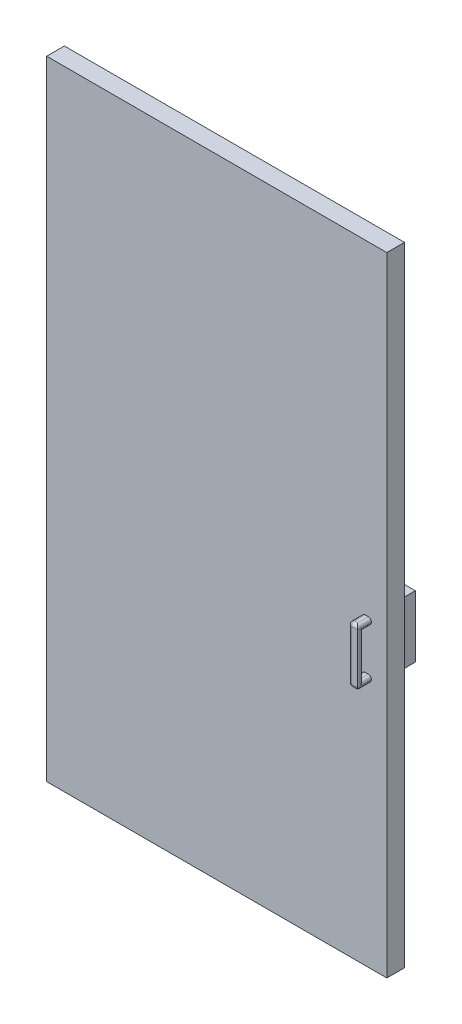
ISO-10303-21;
HEADER;
FILE_DESCRIPTION(('STEP AP214'),'2;1');
FILE_NAME('part.step','',(''),(''),'','','');
FILE_SCHEMA(('AUTOMOTIVE_DESIGN { 1 0 10303 214 1 1 1 1 }'));
ENDSEC;
DATA;
#1=APPLICATION_CONTEXT('core data for automotive mechanical design processes');
#2=APPLICATION_PROTOCOL_DEFINITION('international standard','automotive_design',2000,#1);
#3=PRODUCT_CONTEXT('',#1,'mechanical');
#4=PRODUCT('Part','Part','',(#3));
#5=PRODUCT_RELATED_PRODUCT_CATEGORY('part','',(#4));
#6=PRODUCT_DEFINITION_FORMATION('','',#4);
#7=PRODUCT_DEFINITION_CONTEXT('part definition',#1,'design');
#8=PRODUCT_DEFINITION('design','',#6,#7);
#9=PRODUCT_DEFINITION_SHAPE('','',#8);
#10=(LENGTH_UNIT() NAMED_UNIT(*) SI_UNIT(.MILLI.,.METRE.));
#11=(NAMED_UNIT(*) PLANE_ANGLE_UNIT() SI_UNIT($,.RADIAN.));
#12=(NAMED_UNIT(*) SI_UNIT($,.STERADIAN.) SOLID_ANGLE_UNIT());
#13=UNCERTAINTY_MEASURE_WITH_UNIT(LENGTH_MEASURE(1.E-05),#10,'distance_accuracy_value','');
#14=(GEOMETRIC_REPRESENTATION_CONTEXT(3) GLOBAL_UNCERTAINTY_ASSIGNED_CONTEXT((#13)) GLOBAL_UNIT_ASSIGNED_CONTEXT((#10,
#11,#12)) REPRESENTATION_CONTEXT('',''));
#15=CARTESIAN_POINT('',(0.,0.,0.));
#16=DIRECTION('',(0.,0.,1.));
#17=DIRECTION('',(1.,0.,0.));
#18=AXIS2_PLACEMENT_3D('',#15,#16,#17);
#19=CARTESIAN_POINT('',(0.,0.,0.));
#20=DIRECTION('',(0.,0.,1.));
#21=DIRECTION('',(1.,0.,0.));
#22=AXIS2_PLACEMENT_3D('',#19,#20,#21);
#23=PLANE('',#22);
#24=DIRECTION('',(0.,-1.,0.));
#25=VECTOR('',#24,1.);
#26=CARTESIAN_POINT('',(-65.,-612.048700510207,0.));
#27=LINE('',#26,#25);
#28=CARTESIAN_POINT('',(-65.,-786.763140089581,0.));
#29=VERTEX_POINT('',#28);
#30=CARTESIAN_POINT('',(-65.,-812.048700510207,0.));
#31=VERTEX_POINT('',#30);
#32=EDGE_CURVE('E264',#29,#31,#27,.T.);
#33=ORIENTED_EDGE('',*,*,#32,.F.);
#34=DIRECTION('',(1.,0.,0.));
#35=VECTOR('',#34,1.);
#36=CARTESIAN_POINT('',(-304.278655323462,-786.763140089581,0.));
#37=LINE('',#36,#35);
#38=CARTESIAN_POINT('',(-135.,-786.763140089581,0.));
#39=VERTEX_POINT('',#38);
#40=EDGE_CURVE('E56',#39,#29,#37,.T.);
#41=ORIENTED_EDGE('',*,*,#40,.F.);
#42=DIRECTION('',(0.,1.,0.));
#43=VECTOR('',#42,1.);
#44=CARTESIAN_POINT('',(-135.,-612.048700510207,0.));
#45=LINE('',#44,#43);
#46=CARTESIAN_POINT('',(-135.,-812.048700510207,0.));
#47=VERTEX_POINT('',#46);
#48=EDGE_CURVE('E283',#47,#39,#45,.T.);
#49=ORIENTED_EDGE('',*,*,#48,.F.);
#50=DIRECTION('',(-1.,0.,0.));
#51=VECTOR('',#50,1.);
#52=CARTESIAN_POINT('',(-65.,-812.048700510207,0.));
#53=LINE('',#52,#51);
#54=EDGE_CURVE('E279',#31,#47,#53,.T.);
#55=ORIENTED_EDGE('',*,*,#54,.F.);
#56=EDGE_LOOP('',(#33,#41,#49,#55));
#57=FACE_BOUND('',#56,.T.);
#58=DIRECTION('',(-1.,0.,0.));
#59=VECTOR('',#58,1.);
#60=CARTESIAN_POINT('',(0.,446.201837212028,0.));
#61=LINE('',#60,#59);
#62=CARTESIAN_POINT('',(0.,446.201837212028,0.));
#63=VERTEX_POINT('',#62);
#64=CARTESIAN_POINT('',(-1100.,446.201837212028,0.));
#65=VERTEX_POINT('',#64);
#66=EDGE_CURVE('E317',#63,#65,#61,.T.);
#67=ORIENTED_EDGE('',*,*,#66,.F.);
#68=DIRECTION('',(0.,1.,0.));
#69=VECTOR('',#68,1.);
#70=CARTESIAN_POINT('',(0.,0.,0.));
#71=LINE('',#70,#69);
#72=CARTESIAN_POINT('',(0.,-1585.79816278797,0.));
#73=VERTEX_POINT('',#72);
#74=EDGE_CURVE('E335',#73,#63,#71,.T.);
#75=ORIENTED_EDGE('',*,*,#74,.F.);
#76=DIRECTION('',(1.,0.,0.));
#77=VECTOR('',#76,1.);
#78=CARTESIAN_POINT('',(-1100.,-1585.79816278797,0.));
#79=LINE('',#78,#77);
#80=CARTESIAN_POINT('',(-1100.,-1585.79816278797,0.));
#81=VERTEX_POINT('',#80);
#82=EDGE_CURVE('E346',#81,#73,#79,.T.);
#83=ORIENTED_EDGE('',*,*,#82,.F.);
#84=DIRECTION('',(0.,-1.,0.));
#85=VECTOR('',#84,1.);
#86=CARTESIAN_POINT('',(-1100.,446.201837212028,0.));
#87=LINE('',#86,#85);
#88=EDGE_CURVE('E344',#65,#81,#87,.T.);
#89=ORIENTED_EDGE('',*,*,#88,.F.);
#90=EDGE_LOOP('',(#67,#75,#83,#89));
#91=FACE_BOUND('',#90,.T.);
#92=CARTESIAN_POINT('',(-65.,-612.048700510207,0.));
#93=VERTEX_POINT('',#92);
#94=CARTESIAN_POINT('',(-65.,-627.935575947084,0.));
#95=VERTEX_POINT('',#94);
#96=EDGE_CURVE('E277',#93,#95,#27,.T.);
#97=ORIENTED_EDGE('',*,*,#96,.F.);
#98=DIRECTION('',(1.,0.,0.));
#99=VECTOR('',#98,1.);
#100=CARTESIAN_POINT('',(-65.,-612.048700510207,0.));
#101=LINE('',#100,#99);
#102=CARTESIAN_POINT('',(-135.,-612.048700510207,0.));
#103=VERTEX_POINT('',#102);
#104=EDGE_CURVE('E270',#103,#93,#101,.T.);
#105=ORIENTED_EDGE('',*,*,#104,.F.);
#106=CARTESIAN_POINT('',(-135.,-627.935575947084,0.));
#107=VERTEX_POINT('',#106);
#108=EDGE_CURVE('E282',#107,#103,#45,.T.);
#109=ORIENTED_EDGE('',*,*,#108,.F.);
#110=DIRECTION('',(1.,0.,0.));
#111=VECTOR('',#110,1.);
#112=CARTESIAN_POINT('',(-304.278655323462,-627.935575947084,0.));
#113=LINE('',#112,#111);
#114=EDGE_CURVE('E258',#107,#95,#113,.T.);
#115=ORIENTED_EDGE('',*,*,#114,.T.);
#116=EDGE_LOOP('',(#97,#105,#109,#115));
#117=FACE_BOUND('',#116,.T.);
#118=ADVANCED_FACE('F39',(#57,#91,#117),#23,.F.);
#119=CARTESIAN_POINT('',(-79.9999999999999,-603.798162787972,101.15));
#120=DIRECTION('',(1.,0.,0.));
#121=DIRECTION('',(0.,1.,0.));
#122=AXIS2_PLACEMENT_3D('',#119,#120,#121);
#123=PLANE('',#122);
#124=DIRECTION('',(0.,-1.,0.));
#125=VECTOR('',#124,1.);
#126=CARTESIAN_POINT('',(-79.9999999999999,-603.798162787972,57.15));
#127=LINE('',#126,#125);
#128=CARTESIAN_POINT('',(-79.9999999999999,-774.798162787972,57.15));
#129=VERTEX_POINT('',#128);
#130=CARTESIAN_POINT('',(-79.9999999999999,-775.798162787972,57.15));
#131=VERTEX_POINT('',#130);
#132=EDGE_CURVE('E325',#129,#131,#127,.T.);
#133=ORIENTED_EDGE('',*,*,#132,.T.);
#134=DIRECTION('',(0.,0.,-1.));
#135=VECTOR('',#134,1.);
#136=CARTESIAN_POINT('',(-79.9999999999999,-775.798162787972,101.15));
#137=LINE('',#136,#135);
#138=CARTESIAN_POINT('',(-79.9999999999999,-775.798162787972,91.15));
#139=VERTEX_POINT('',#138);
#140=EDGE_CURVE('E388',#131,#139,#137,.F.);
#141=ORIENTED_EDGE('',*,*,#140,.T.);
#142=DIRECTION('',(0.,-1.,0.));
#143=VECTOR('',#142,1.);
#144=CARTESIAN_POINT('',(-79.9999999999999,-603.798162787972,91.15));
#145=LINE('',#144,#143);
#146=CARTESIAN_POINT('',(-79.9999999999999,-774.798162787972,91.15));
#147=VERTEX_POINT('',#146);
#148=EDGE_CURVE('E384',#139,#147,#145,.F.);
#149=ORIENTED_EDGE('',*,*,#148,.T.);
#150=DIRECTION('',(0.,0.,-1.));
#151=VECTOR('',#150,1.);
#152=CARTESIAN_POINT('',(-79.9999999999999,-774.798162787972,57.15));
#153=LINE('',#152,#151);
#154=EDGE_CURVE('E386',#147,#129,#153,.T.);
#155=ORIENTED_EDGE('',*,*,#154,.T.);
#156=EDGE_LOOP('',(#133,#141,#149,#155));
#157=FACE_BOUND('',#156,.T.);
#158=ADVANCED_FACE('F558',(#157),#123,.F.);
#159=CARTESIAN_POINT('',(-49.9999999999999,-603.798162787972,101.15));
#160=DIRECTION('',(-1.,0.,0.));
#161=DIRECTION('',(0.,-1.,0.));
#162=AXIS2_PLACEMENT_3D('',#159,#160,#161);
#163=PLANE('',#162);
#164=DIRECTION('',(0.,1.,0.));
#165=VECTOR('',#164,1.);
#166=CARTESIAN_POINT('',(-49.9999999999999,-603.798162787972,57.15));
#167=LINE('',#166,#165);
#168=CARTESIAN_POINT('',(-49.9999999999999,-614.798162787972,57.15));
#169=VERTEX_POINT('',#168);
#170=CARTESIAN_POINT('',(-49.9999999999999,-613.798162787972,57.15));
#171=VERTEX_POINT('',#170);
#172=EDGE_CURVE('E303',#169,#171,#167,.T.);
#173=ORIENTED_EDGE('',*,*,#172,.T.);
#174=DIRECTION('',(0.,0.,-1.));
#175=VECTOR('',#174,1.);
#176=CARTESIAN_POINT('',(-49.9999999999999,-613.798162787972,101.15));
#177=LINE('',#176,#175);
#178=CARTESIAN_POINT('',(-49.9999999999999,-613.798162787972,101.15));
#179=VERTEX_POINT('',#178);
#180=EDGE_CURVE('E403',#171,#179,#177,.F.);
#181=ORIENTED_EDGE('',*,*,#180,.T.);
#182=DIRECTION('',(0.,1.,0.));
#183=VECTOR('',#182,1.);
#184=CARTESIAN_POINT('',(-49.9999999999999,-603.798162787972,101.15));
#185=LINE('',#184,#183);
#186=CARTESIAN_POINT('',(-49.9999999999999,-775.798162787972,101.15));
#187=VERTEX_POINT('',#186);
#188=EDGE_CURVE('E314',#187,#179,#185,.T.);
#189=ORIENTED_EDGE('',*,*,#188,.F.);
#190=DIRECTION('',(0.,0.,-1.));
#191=VECTOR('',#190,1.);
#192=CARTESIAN_POINT('',(-49.9999999999999,-775.798162787972,101.15));
#193=LINE('',#192,#191);
#194=CARTESIAN_POINT('',(-49.9999999999999,-775.798162787972,57.15));
#195=VERTEX_POINT('',#194);
#196=EDGE_CURVE('E395',#187,#195,#193,.T.);
#197=ORIENTED_EDGE('',*,*,#196,.T.);
#198=CARTESIAN_POINT('',(-49.9999999999999,-774.798162787972,57.15));
#199=VERTEX_POINT('',#198);
#200=EDGE_CURVE('E319',#195,#199,#167,.T.);
#201=ORIENTED_EDGE('',*,*,#200,.T.);
#202=DIRECTION('',(0.,0.,-1.));
#203=VECTOR('',#202,1.);
#204=CARTESIAN_POINT('',(-49.9999999999999,-774.798162787972,83.15));
#205=LINE('',#204,#203);
#206=CARTESIAN_POINT('',(-49.9999999999999,-774.798162787972,93.15));
#207=VERTEX_POINT('',#206);
#208=EDGE_CURVE('E397',#199,#207,#205,.F.);
#209=ORIENTED_EDGE('',*,*,#208,.T.);
#210=DIRECTION('',(0.,-1.,0.));
#211=VECTOR('',#210,1.);
#212=CARTESIAN_POINT('',(-49.9999999999999,-624.798162787972,93.15));
#213=LINE('',#212,#211);
#214=CARTESIAN_POINT('',(-49.9999999999999,-614.798162787972,93.15));
#215=VERTEX_POINT('',#214);
#216=EDGE_CURVE('E399',#207,#215,#213,.F.);
#217=ORIENTED_EDGE('',*,*,#216,.T.);
#218=DIRECTION('',(0.,0.,1.));
#219=VECTOR('',#218,1.);
#220=CARTESIAN_POINT('',(-49.9999999999999,-614.798162787972,57.15));
#221=LINE('',#220,#219);
#222=EDGE_CURVE('E401',#215,#169,#221,.F.);
#223=ORIENTED_EDGE('',*,*,#222,.T.);
#224=EDGE_LOOP('',(#173,#181,#189,#197,#201,#209,#217,#223));
#225=FACE_BOUND('',#224,.T.);
#226=ADVANCED_FACE('F545',(#225),#163,.F.);
#227=DIRECTION('',(0.,-1.,0.));
#228=VECTOR('',#227,1.);
#229=CARTESIAN_POINT('',(-79.9999999999999,-603.798162787972,91.15));
#230=LINE('',#229,#228);
#231=CARTESIAN_POINT('',(-79.9999999999999,-614.798162787972,91.15));
#232=VERTEX_POINT('',#231);
#233=CARTESIAN_POINT('',(-79.9999999999999,-613.798162787972,91.15));
#234=VERTEX_POINT('',#233);
#235=EDGE_CURVE('E378',#232,#234,#230,.F.);
#236=ORIENTED_EDGE('',*,*,#235,.T.);
#237=DIRECTION('',(0.,0.,-1.));
#238=VECTOR('',#237,1.);
#239=CARTESIAN_POINT('',(-79.9999999999999,-613.798162787972,101.15));
#240=LINE('',#239,#238);
#241=CARTESIAN_POINT('',(-79.9999999999999,-613.798162787972,57.15));
#242=VERTEX_POINT('',#241);
#243=EDGE_CURVE('E382',#234,#242,#240,.T.);
#244=ORIENTED_EDGE('',*,*,#243,.T.);
#245=CARTESIAN_POINT('',(-79.9999999999999,-614.798162787972,57.15));
#246=VERTEX_POINT('',#245);
#247=EDGE_CURVE('E326',#242,#246,#127,.T.);
#248=ORIENTED_EDGE('',*,*,#247,.T.);
#249=DIRECTION('',(0.,0.,1.));
#250=VECTOR('',#249,1.);
#251=CARTESIAN_POINT('',(-79.9999999999999,-614.798162787972,83.15));
#252=LINE('',#251,#250);
#253=EDGE_CURVE('E380',#246,#232,#252,.T.);
#254=ORIENTED_EDGE('',*,*,#253,.T.);
#255=EDGE_LOOP('',(#236,#244,#248,#254));
#256=FACE_BOUND('',#255,.T.);
#257=ADVANCED_FACE('F515',(#256),#123,.F.);
#258=CARTESIAN_POINT('',(0.,0.,57.15));
#259=DIRECTION('',(0.,0.,1.));
#260=DIRECTION('',(1.,0.,0.));
#261=AXIS2_PLACEMENT_3D('',#258,#259,#260);
#262=PLANE('',#261);
#263=DIRECTION('',(-1.,0.,0.));
#264=VECTOR('',#263,1.);
#265=CARTESIAN_POINT('',(-35.9999999999999,-764.798162787972,57.15));
#266=LINE('',#265,#264);
#267=CARTESIAN_POINT('',(-59.9999999999999,-764.798162787972,57.15));
#268=VERTEX_POINT('',#267);
#269=CARTESIAN_POINT('',(-69.9999999999999,-764.798162787972,57.15));
#270=VERTEX_POINT('',#269);
#271=EDGE_CURVE('E300',#268,#270,#266,.T.);
#272=ORIENTED_EDGE('',*,*,#271,.F.);
#273=CARTESIAN_POINT('',(-59.9999999999999,-774.798162787972,57.15));
#274=DIRECTION('',(0.,0.,1.));
#275=DIRECTION('',(1.,0.,0.));
#276=AXIS2_PLACEMENT_3D('',#273,#274,#275);
#277=CIRCLE('',#276,10.);
#278=EDGE_CURVE('E423',#268,#199,#277,.F.);
#279=ORIENTED_EDGE('',*,*,#278,.T.);
#280=ORIENTED_EDGE('',*,*,#200,.F.);
#281=CARTESIAN_POINT('',(-59.9999999999999,-775.798162787972,57.15));
#282=DIRECTION('',(0.,0.,1.));
#283=DIRECTION('',(1.,0.,0.));
#284=AXIS2_PLACEMENT_3D('',#281,#282,#283);
#285=CIRCLE('',#284,10.);
#286=CARTESIAN_POINT('',(-59.9999999999999,-785.798162787972,57.15));
#287=VERTEX_POINT('',#286);
#288=EDGE_CURVE('E425',#195,#287,#285,.F.);
#289=ORIENTED_EDGE('',*,*,#288,.T.);
#290=DIRECTION('',(1.,0.,0.));
#291=VECTOR('',#290,1.);
#292=CARTESIAN_POINT('',(-79.9999999999999,-785.798162787972,57.15));
#293=LINE('',#292,#291);
#294=CARTESIAN_POINT('',(-69.9999999999999,-785.798162787972,57.15));
#295=VERTEX_POINT('',#294);
#296=EDGE_CURVE('E318',#295,#287,#293,.T.);
#297=ORIENTED_EDGE('',*,*,#296,.F.);
#298=CARTESIAN_POINT('',(-69.9999999999999,-775.798162787972,57.15));
#299=DIRECTION('',(0.,0.,1.));
#300=DIRECTION('',(1.,0.,0.));
#301=AXIS2_PLACEMENT_3D('',#298,#299,#300);
#302=CIRCLE('',#301,10.);
#303=EDGE_CURVE('E48',#295,#131,#302,.F.);
#304=ORIENTED_EDGE('',*,*,#303,.T.);
#305=ORIENTED_EDGE('',*,*,#132,.F.);
#306=CARTESIAN_POINT('',(-69.9999999999999,-774.798162787972,57.15));
#307=DIRECTION('',(0.,0.,1.));
#308=DIRECTION('',(1.,0.,0.));
#309=AXIS2_PLACEMENT_3D('',#306,#307,#308);
#310=CIRCLE('',#309,10.);
#311=EDGE_CURVE('E11',#129,#270,#310,.F.);
#312=ORIENTED_EDGE('',*,*,#311,.T.);
#313=EDGE_LOOP('',(#272,#279,#280,#289,#297,#304,#305,#312));
#314=FACE_BOUND('',#313,.T.);
#315=ORIENTED_EDGE('',*,*,#172,.F.);
#316=CARTESIAN_POINT('',(-59.9999999999999,-614.798162787972,57.15));
#317=DIRECTION('',(0.,0.,1.));
#318=DIRECTION('',(1.,0.,0.));
#319=AXIS2_PLACEMENT_3D('',#316,#317,#318);
#320=CIRCLE('',#319,10.);
#321=CARTESIAN_POINT('',(-59.9999999999999,-624.798162787972,57.15));
#322=VERTEX_POINT('',#321);
#323=EDGE_CURVE('E421',#169,#322,#320,.F.);
#324=ORIENTED_EDGE('',*,*,#323,.T.);
#325=DIRECTION('',(-1.,0.,0.));
#326=VECTOR('',#325,1.);
#327=CARTESIAN_POINT('',(-35.9999999999999,-624.798162787972,57.15));
#328=LINE('',#327,#326);
#329=CARTESIAN_POINT('',(-69.9999999999999,-624.798162787972,57.15));
#330=VERTEX_POINT('',#329);
#331=EDGE_CURVE('E304',#322,#330,#328,.T.);
#332=ORIENTED_EDGE('',*,*,#331,.T.);
#333=CARTESIAN_POINT('',(-69.9999999999999,-614.798162787972,57.15));
#334=DIRECTION('',(0.,0.,1.));
#335=DIRECTION('',(1.,0.,0.));
#336=AXIS2_PLACEMENT_3D('',#333,#334,#335);
#337=CIRCLE('',#336,10.);
#338=EDGE_CURVE('E417',#330,#246,#337,.F.);
#339=ORIENTED_EDGE('',*,*,#338,.T.);
#340=ORIENTED_EDGE('',*,*,#247,.F.);
#341=CARTESIAN_POINT('',(-69.9999999999999,-613.798162787972,57.15));
#342=DIRECTION('',(0.,0.,1.));
#343=DIRECTION('',(1.,0.,0.));
#344=AXIS2_PLACEMENT_3D('',#341,#342,#343);
#345=CIRCLE('',#344,10.);
#346=CARTESIAN_POINT('',(-69.9999999999999,-603.798162787972,57.15));
#347=VERTEX_POINT('',#346);
#348=EDGE_CURVE('E415',#242,#347,#345,.F.);
#349=ORIENTED_EDGE('',*,*,#348,.T.);
#350=DIRECTION('',(-1.,0.,0.));
#351=VECTOR('',#350,1.);
#352=CARTESIAN_POINT('',(-79.9999999999999,-603.798162787972,57.15));
#353=LINE('',#352,#351);
#354=CARTESIAN_POINT('',(-59.9999999999999,-603.798162787972,57.15));
#355=VERTEX_POINT('',#354);
#356=EDGE_CURVE('E322',#355,#347,#353,.T.);
#357=ORIENTED_EDGE('',*,*,#356,.F.);
#358=CARTESIAN_POINT('',(-59.9999999999999,-613.798162787972,57.15));
#359=DIRECTION('',(0.,0.,1.));
#360=DIRECTION('',(1.,0.,0.));
#361=AXIS2_PLACEMENT_3D('',#358,#359,#360);
#362=CIRCLE('',#361,10.);
#363=EDGE_CURVE('E419',#355,#171,#362,.F.);
#364=ORIENTED_EDGE('',*,*,#363,.T.);
#365=EDGE_LOOP('',(#315,#324,#332,#339,#340,#349,#357,#364));
#366=FACE_BOUND('',#365,.T.);
#367=DIRECTION('',(-1.,0.,0.));
#368=VECTOR('',#367,1.);
#369=CARTESIAN_POINT('',(0.,446.201837212028,57.15));
#370=LINE('',#369,#368);
#371=CARTESIAN_POINT('',(0.,446.201837212028,57.15));
#372=VERTEX_POINT('',#371);
#373=CARTESIAN_POINT('',(-1100.,446.201837212028,57.15));
#374=VERTEX_POINT('',#373);
#375=EDGE_CURVE('E331',#372,#374,#370,.T.);
#376=ORIENTED_EDGE('',*,*,#375,.T.);
#377=DIRECTION('',(0.,-1.,0.));
#378=VECTOR('',#377,1.);
#379=CARTESIAN_POINT('',(-1100.,446.201837212028,57.15));
#380=LINE('',#379,#378);
#381=CARTESIAN_POINT('',(-1100.,-1585.79816278797,57.15));
#382=VERTEX_POINT('',#381);
#383=EDGE_CURVE('E334',#374,#382,#380,.T.);
#384=ORIENTED_EDGE('',*,*,#383,.T.);
#385=DIRECTION('',(1.,0.,0.));
#386=VECTOR('',#385,1.);
#387=CARTESIAN_POINT('',(-1100.,-1585.79816278797,57.15));
#388=LINE('',#387,#386);
#389=CARTESIAN_POINT('',(0.,-1585.79816278797,57.15));
#390=VERTEX_POINT('',#389);
#391=EDGE_CURVE('E337',#382,#390,#388,.T.);
#392=ORIENTED_EDGE('',*,*,#391,.T.);
#393=DIRECTION('',(0.,1.,0.));
#394=VECTOR('',#393,1.);
#395=CARTESIAN_POINT('',(0.,-1585.79816278797,57.15));
#396=LINE('',#395,#394);
#397=EDGE_CURVE('E339',#390,#372,#396,.T.);
#398=ORIENTED_EDGE('',*,*,#397,.T.);
#399=EDGE_LOOP('',(#376,#384,#392,#398));
#400=FACE_BOUND('',#399,.T.);
#401=ADVANCED_FACE('F482',(#314,#366,#400),#262,.T.);
#402=CARTESIAN_POINT('',(0.,446.201837212028,57.15));
#403=DIRECTION('',(0.,-1.,0.));
#404=DIRECTION('',(1.,0.,0.));
#405=AXIS2_PLACEMENT_3D('',#402,#403,#404);
#406=PLANE('',#405);
#407=ORIENTED_EDGE('',*,*,#66,.T.);
#408=DIRECTION('',(0.,0.,-1.));
#409=VECTOR('',#408,1.);
#410=CARTESIAN_POINT('',(-1100.,446.201837212028,57.15));
#411=LINE('',#410,#409);
#412=EDGE_CURVE('E358',#374,#65,#411,.T.);
#413=ORIENTED_EDGE('',*,*,#412,.F.);
#414=ORIENTED_EDGE('',*,*,#375,.F.);
#415=DIRECTION('',(0.,0.,-1.));
#416=VECTOR('',#415,1.);
#417=CARTESIAN_POINT('',(0.,446.201837212028,57.15));
#418=LINE('',#417,#416);
#419=EDGE_CURVE('E341',#372,#63,#418,.T.);
#420=ORIENTED_EDGE('',*,*,#419,.T.);
#421=EDGE_LOOP('',(#407,#413,#414,#420));
#422=FACE_BOUND('',#421,.T.);
#423=ADVANCED_FACE('F581',(#422),#406,.F.);
#424=CARTESIAN_POINT('',(-1100.,446.201837212028,57.15));
#425=DIRECTION('',(1.,0.,0.));
#426=DIRECTION('',(0.,0.,-1.));
#427=AXIS2_PLACEMENT_3D('',#424,#425,#426);
#428=PLANE('',#427);
#429=ORIENTED_EDGE('',*,*,#88,.T.);
#430=DIRECTION('',(0.,0.,-1.));
#431=VECTOR('',#430,1.);
#432=CARTESIAN_POINT('',(-1100.,-1585.79816278797,57.15));
#433=LINE('',#432,#431);
#434=EDGE_CURVE('E355',#382,#81,#433,.T.);
#435=ORIENTED_EDGE('',*,*,#434,.F.);
#436=ORIENTED_EDGE('',*,*,#383,.F.);
#437=ORIENTED_EDGE('',*,*,#412,.T.);
#438=EDGE_LOOP('',(#429,#435,#436,#437));
#439=FACE_BOUND('',#438,.T.);
#440=ADVANCED_FACE('F577',(#439),#428,.F.);
#441=CARTESIAN_POINT('',(-1100.,-1585.79816278797,57.15));
#442=DIRECTION('',(0.,1.,0.));
#443=DIRECTION('',(0.,0.,1.));
#444=AXIS2_PLACEMENT_3D('',#441,#442,#443);
#445=PLANE('',#444);
#446=ORIENTED_EDGE('',*,*,#82,.T.);
#447=DIRECTION('',(0.,0.,-1.));
#448=VECTOR('',#447,1.);
#449=CARTESIAN_POINT('',(0.,-1585.79816278797,57.15));
#450=LINE('',#449,#448);
#451=EDGE_CURVE('E352',#390,#73,#450,.T.);
#452=ORIENTED_EDGE('',*,*,#451,.F.);
#453=ORIENTED_EDGE('',*,*,#391,.F.);
#454=ORIENTED_EDGE('',*,*,#434,.T.);
#455=EDGE_LOOP('',(#446,#452,#453,#454));
#456=FACE_BOUND('',#455,.T.);
#457=ADVANCED_FACE('F573',(#456),#445,.F.);
#458=CARTESIAN_POINT('',(0.,0.,57.15));
#459=DIRECTION('',(-1.,0.,0.));
#460=DIRECTION('',(0.,0.,1.));
#461=AXIS2_PLACEMENT_3D('',#458,#459,#460);
#462=PLANE('',#461);
#463=ORIENTED_EDGE('',*,*,#74,.T.);
#464=ORIENTED_EDGE('',*,*,#419,.F.);
#465=ORIENTED_EDGE('',*,*,#397,.F.);
#466=ORIENTED_EDGE('',*,*,#451,.T.);
#467=EDGE_LOOP('',(#463,#464,#465,#466));
#468=FACE_BOUND('',#467,.T.);
#469=ADVANCED_FACE('F570',(#468),#462,.F.);
#470=CARTESIAN_POINT('',(-79.9999999999999,-603.798162787972,101.15));
#471=DIRECTION('',(0.,-1.,0.));
#472=DIRECTION('',(0.,0.,-1.));
#473=AXIS2_PLACEMENT_3D('',#470,#471,#472);
#474=PLANE('',#473);
#475=ORIENTED_EDGE('',*,*,#356,.T.);
#476=DIRECTION('',(0.,0.,-1.));
#477=VECTOR('',#476,1.);
#478=CARTESIAN_POINT('',(-69.9999999999999,-603.798162787972,101.15));
#479=LINE('',#478,#477);
#480=CARTESIAN_POINT('',(-69.9999999999999,-603.798162787972,91.15));
#481=VERTEX_POINT('',#480);
#482=EDGE_CURVE('E372',#347,#481,#479,.F.);
#483=ORIENTED_EDGE('',*,*,#482,.T.);
#484=DIRECTION('',(-1.,0.,0.));
#485=VECTOR('',#484,1.);
#486=CARTESIAN_POINT('',(-49.9999999999999,-603.798162787972,91.15));
#487=LINE('',#486,#485);
#488=CARTESIAN_POINT('',(-59.9999999999999,-603.798162787972,91.15));
#489=VERTEX_POINT('',#488);
#490=EDGE_CURVE('E370',#481,#489,#487,.F.);
#491=ORIENTED_EDGE('',*,*,#490,.T.);
#492=DIRECTION('',(0.,0.,-1.));
#493=VECTOR('',#492,1.);
#494=CARTESIAN_POINT('',(-59.9999999999999,-603.798162787972,101.15));
#495=LINE('',#494,#493);
#496=EDGE_CURVE('E368',#489,#355,#495,.T.);
#497=ORIENTED_EDGE('',*,*,#496,.T.);
#498=EDGE_LOOP('',(#475,#483,#491,#497));
#499=FACE_BOUND('',#498,.T.);
#500=ADVANCED_FACE('F536',(#499),#474,.F.);
#501=CARTESIAN_POINT('',(-79.9999999999999,-785.798162787972,101.15));
#502=DIRECTION('',(0.,1.,0.));
#503=DIRECTION('',(0.,0.,1.));
#504=AXIS2_PLACEMENT_3D('',#501,#502,#503);
#505=PLANE('',#504);
#506=ORIENTED_EDGE('',*,*,#296,.T.);
#507=DIRECTION('',(0.,0.,-1.));
#508=VECTOR('',#507,1.);
#509=CARTESIAN_POINT('',(-59.9999999999999,-785.798162787972,101.15));
#510=LINE('',#509,#508);
#511=CARTESIAN_POINT('',(-59.9999999999999,-785.798162787972,91.15));
#512=VERTEX_POINT('',#511);
#513=EDGE_CURVE('E413',#287,#512,#510,.F.);
#514=ORIENTED_EDGE('',*,*,#513,.T.);
#515=DIRECTION('',(1.,0.,0.));
#516=VECTOR('',#515,1.);
#517=CARTESIAN_POINT('',(-79.9999999999999,-785.798162787972,91.15));
#518=LINE('',#517,#516);
#519=CARTESIAN_POINT('',(-69.9999999999999,-785.798162787972,91.15));
#520=VERTEX_POINT('',#519);
#521=EDGE_CURVE('E409',#512,#520,#518,.F.);
#522=ORIENTED_EDGE('',*,*,#521,.T.);
#523=DIRECTION('',(0.,0.,-1.));
#524=VECTOR('',#523,1.);
#525=CARTESIAN_POINT('',(-69.9999999999999,-785.798162787972,101.15));
#526=LINE('',#525,#524);
#527=EDGE_CURVE('E411',#520,#295,#526,.T.);
#528=ORIENTED_EDGE('',*,*,#527,.T.);
#529=EDGE_LOOP('',(#506,#514,#522,#528));
#530=FACE_BOUND('',#529,.T.);
#531=ADVANCED_FACE('F627',(#530),#505,.F.);
#532=CARTESIAN_POINT('',(0.,0.,101.15));
#533=DIRECTION('',(0.,0.,1.));
#534=DIRECTION('',(1.,0.,0.));
#535=AXIS2_PLACEMENT_3D('',#532,#533,#534);
#536=PLANE('',#535);
#537=ORIENTED_EDGE('',*,*,#188,.T.);
#538=DIRECTION('',(-1.,0.,0.));
#539=VECTOR('',#538,1.);
#540=CARTESIAN_POINT('',(-79.9999999999999,-613.798162787972,101.15));
#541=LINE('',#540,#539);
#542=CARTESIAN_POINT('',(-69.9999999999999,-613.798162787972,101.15));
#543=VERTEX_POINT('',#542);
#544=EDGE_CURVE('E365',#179,#543,#541,.T.);
#545=ORIENTED_EDGE('',*,*,#544,.T.);
#546=DIRECTION('',(0.,-1.,0.));
#547=VECTOR('',#546,1.);
#548=CARTESIAN_POINT('',(-69.9999999999999,-785.798162787972,101.15));
#549=LINE('',#548,#547);
#550=CARTESIAN_POINT('',(-69.9999999999999,-775.798162787972,101.15));
#551=VERTEX_POINT('',#550);
#552=EDGE_CURVE('E363',#543,#551,#549,.T.);
#553=ORIENTED_EDGE('',*,*,#552,.T.);
#554=DIRECTION('',(1.,0.,0.));
#555=VECTOR('',#554,1.);
#556=CARTESIAN_POINT('',(-49.9999999999999,-775.798162787972,101.15));
#557=LINE('',#556,#555);
#558=EDGE_CURVE('E361',#551,#187,#557,.T.);
#559=ORIENTED_EDGE('',*,*,#558,.T.);
#560=EDGE_LOOP('',(#537,#545,#553,#559));
#561=FACE_BOUND('',#560,.T.);
#562=ADVANCED_FACE('F637',(#561),#536,.T.);
#563=CARTESIAN_POINT('',(-35.9999999999999,-764.798162787972,0.));
#564=DIRECTION('',(0.,1.,0.));
#565=DIRECTION('',(-1.,0.,0.));
#566=AXIS2_PLACEMENT_3D('',#563,#564,#565);
#567=PLANE('',#566);
#568=DIRECTION('',(-1.,0.,0.));
#569=VECTOR('',#568,1.);
#570=CARTESIAN_POINT('',(-35.9999999999999,-764.798162787972,83.15));
#571=LINE('',#570,#569);
#572=CARTESIAN_POINT('',(-59.9999999999999,-764.798162787972,83.15));
#573=VERTEX_POINT('',#572);
#574=CARTESIAN_POINT('',(-69.9999999999999,-764.798162787972,83.15));
#575=VERTEX_POINT('',#574);
#576=EDGE_CURVE('E310',#573,#575,#571,.T.);
#577=ORIENTED_EDGE('',*,*,#576,.F.);
#578=DIRECTION('',(0.,0.,-1.));
#579=VECTOR('',#578,1.);
#580=CARTESIAN_POINT('',(-59.9999999999999,-764.798162787972,57.15));
#581=LINE('',#580,#579);
#582=EDGE_CURVE('E407',#573,#268,#581,.T.);
#583=ORIENTED_EDGE('',*,*,#582,.T.);
#584=ORIENTED_EDGE('',*,*,#271,.T.);
#585=DIRECTION('',(0.,0.,-1.));
#586=VECTOR('',#585,1.);
#587=CARTESIAN_POINT('',(-69.9999999999999,-764.798162787972,83.15));
#588=LINE('',#587,#586);
#589=EDGE_CURVE('E405',#270,#575,#588,.F.);
#590=ORIENTED_EDGE('',*,*,#589,.T.);
#591=EDGE_LOOP('',(#577,#583,#584,#590));
#592=FACE_BOUND('',#591,.T.);
#593=ADVANCED_FACE('F479',(#592),#567,.T.);
#594=CARTESIAN_POINT('',(-35.9999999999999,-624.798162787972,0.));
#595=DIRECTION('',(0.,-1.,0.));
#596=DIRECTION('',(1.,0.,0.));
#597=AXIS2_PLACEMENT_3D('',#594,#595,#596);
#598=PLANE('',#597);
#599=DIRECTION('',(-1.,0.,0.));
#600=VECTOR('',#599,1.);
#601=CARTESIAN_POINT('',(-35.9999999999999,-624.798162787972,83.15));
#602=LINE('',#601,#600);
#603=CARTESIAN_POINT('',(-59.9999999999999,-624.798162787972,83.15));
#604=VERTEX_POINT('',#603);
#605=CARTESIAN_POINT('',(-69.9999999999999,-624.798162787972,83.15));
#606=VERTEX_POINT('',#605);
#607=EDGE_CURVE('E307',#604,#606,#602,.T.);
#608=ORIENTED_EDGE('',*,*,#607,.T.);
#609=DIRECTION('',(0.,0.,1.));
#610=VECTOR('',#609,1.);
#611=CARTESIAN_POINT('',(-69.9999999999999,-624.798162787972,57.15));
#612=LINE('',#611,#610);
#613=EDGE_CURVE('E393',#606,#330,#612,.F.);
#614=ORIENTED_EDGE('',*,*,#613,.T.);
#615=ORIENTED_EDGE('',*,*,#331,.F.);
#616=DIRECTION('',(0.,0.,1.));
#617=VECTOR('',#616,1.);
#618=CARTESIAN_POINT('',(-59.9999999999999,-624.798162787972,83.15));
#619=LINE('',#618,#617);
#620=EDGE_CURVE('E390',#322,#604,#619,.T.);
#621=ORIENTED_EDGE('',*,*,#620,.T.);
#622=EDGE_LOOP('',(#608,#614,#615,#621));
#623=FACE_BOUND('',#622,.T.);
#624=ADVANCED_FACE('F499',(#623),#598,.T.);
#625=CARTESIAN_POINT('',(-36.0000000000001,0.,83.1499999999999));
#626=DIRECTION('',(0.,0.,-1.));
#627=DIRECTION('',(0.,1.,0.));
#628=AXIS2_PLACEMENT_3D('',#625,#626,#627);
#629=PLANE('',#628);
#630=ORIENTED_EDGE('',*,*,#576,.T.);
#631=DIRECTION('',(0.,-1.,0.));
#632=VECTOR('',#631,1.);
#633=CARTESIAN_POINT('',(-69.9999999999999,-624.798162787972,83.15));
#634=LINE('',#633,#632);
#635=EDGE_CURVE('E376',#575,#606,#634,.F.);
#636=ORIENTED_EDGE('',*,*,#635,.T.);
#637=ORIENTED_EDGE('',*,*,#607,.F.);
#638=DIRECTION('',(0.,-1.,0.));
#639=VECTOR('',#638,1.);
#640=CARTESIAN_POINT('',(-59.9999999999999,-764.798162787972,83.15));
#641=LINE('',#640,#639);
#642=EDGE_CURVE('E374',#604,#573,#641,.T.);
#643=ORIENTED_EDGE('',*,*,#642,.T.);
#644=EDGE_LOOP('',(#630,#636,#637,#643));
#645=FACE_BOUND('',#644,.T.);
#646=ADVANCED_FACE('F495',(#645),#629,.T.);
#647=CARTESIAN_POINT('',(-59.9999999999999,-775.798162787972,101.15));
#648=DIRECTION('',(0.,0.,-1.));
#649=DIRECTION('',(-1.,0.,0.));
#650=AXIS2_PLACEMENT_3D('',#647,#648,#649);
#651=CYLINDRICAL_SURFACE('',#650,10.);
#652=ORIENTED_EDGE('',*,*,#288,.F.);
#653=ORIENTED_EDGE('',*,*,#196,.F.);
#654=CARTESIAN_POINT('',(-59.9999999999999,-775.798162787972,91.15));
#655=DIRECTION('',(-0.707106781186547,0.,0.707106781186547));
#656=DIRECTION('',(-0.707106781186547,0.,-0.707106781186547));
#657=AXIS2_PLACEMENT_3D('',#654,#655,#656);
#658=ELLIPSE('',#657,14.1421356237309,10.);
#659=EDGE_CURVE('E313',#512,#187,#658,.T.);
#660=ORIENTED_EDGE('',*,*,#659,.F.);
#661=ORIENTED_EDGE('',*,*,#513,.F.);
#662=EDGE_LOOP('',(#652,#653,#660,#661));
#663=FACE_BOUND('',#662,.T.);
#664=ADVANCED_FACE('F612',(#663),#651,.T.);
#665=CARTESIAN_POINT('',(0.,-775.798162787972,91.15));
#666=DIRECTION('',(-1.,0.,0.));
#667=DIRECTION('',(0.,0.,1.));
#668=AXIS2_PLACEMENT_3D('',#665,#666,#667);
#669=CYLINDRICAL_SURFACE('',#668,10.);
#670=ORIENTED_EDGE('',*,*,#659,.T.);
#671=ORIENTED_EDGE('',*,*,#558,.F.);
#672=CARTESIAN_POINT('',(-69.9999999999999,-775.798162787972,91.15));
#673=DIRECTION('',(-1.,0.,0.));
#674=DIRECTION('',(0.,0.,1.));
#675=AXIS2_PLACEMENT_3D('',#672,#673,#674);
#676=CIRCLE('',#675,10.);
#677=EDGE_CURVE('E458',#520,#551,#676,.T.);
#678=ORIENTED_EDGE('',*,*,#677,.F.);
#679=ORIENTED_EDGE('',*,*,#521,.F.);
#680=EDGE_LOOP('',(#670,#671,#678,#679));
#681=FACE_BOUND('',#680,.T.);
#682=ADVANCED_FACE('F609',(#681),#669,.T.);
#683=CARTESIAN_POINT('',(-69.9999999999999,-775.798162787972,101.15));
#684=DIRECTION('',(0.,0.,-1.));
#685=DIRECTION('',(-1.,0.,0.));
#686=AXIS2_PLACEMENT_3D('',#683,#684,#685);
#687=CYLINDRICAL_SURFACE('',#686,10.);
#688=ORIENTED_EDGE('',*,*,#303,.F.);
#689=ORIENTED_EDGE('',*,*,#527,.F.);
#690=CARTESIAN_POINT('',(-69.9999999999999,-775.798162787972,91.15));
#691=DIRECTION('',(0.,0.,1.));
#692=DIRECTION('',(1.,0.,0.));
#693=AXIS2_PLACEMENT_3D('',#690,#691,#692);
#694=CIRCLE('',#693,10.);
#695=EDGE_CURVE('E455',#139,#520,#694,.T.);
#696=ORIENTED_EDGE('',*,*,#695,.F.);
#697=ORIENTED_EDGE('',*,*,#140,.F.);
#698=EDGE_LOOP('',(#688,#689,#696,#697));
#699=FACE_BOUND('',#698,.T.);
#700=ADVANCED_FACE('F605',(#699),#687,.T.);
#701=CARTESIAN_POINT('',(-69.9999999999999,-775.798162787972,91.15));
#702=DIRECTION('',(0.,-1.,0.));
#703=DIRECTION('',(0.,0.,-1.));
#704=AXIS2_PLACEMENT_3D('',#701,#702,#703);
#705=SPHERICAL_SURFACE('',#704,10.);
#706=ORIENTED_EDGE('',*,*,#695,.T.);
#707=ORIENTED_EDGE('',*,*,#677,.T.);
#708=CARTESIAN_POINT('',(-69.9999999999999,-775.798162787972,91.15));
#709=DIRECTION('',(0.,-1.,0.));
#710=DIRECTION('',(0.,0.,-1.));
#711=AXIS2_PLACEMENT_3D('',#708,#709,#710);
#712=CIRCLE('',#711,10.);
#713=EDGE_CURVE('E448',#139,#551,#712,.F.);
#714=ORIENTED_EDGE('',*,*,#713,.F.);
#715=EDGE_LOOP('',(#706,#707,#714));
#716=FACE_BOUND('',#715,.T.);
#717=ADVANCED_FACE('F602',(#716),#705,.T.);
#718=CARTESIAN_POINT('',(-69.9999999999999,-774.798162787972,101.15));
#719=DIRECTION('',(0.,0.,1.));
#720=DIRECTION('',(1.,0.,0.));
#721=AXIS2_PLACEMENT_3D('',#718,#719,#720);
#722=CYLINDRICAL_SURFACE('',#721,10.);
#723=CARTESIAN_POINT('',(-69.9999999999999,-774.798162787972,93.15));
#724=DIRECTION('',(0.,0.707106781186548,0.707106781186547));
#725=DIRECTION('',(0.,0.707106781186547,-0.707106781186547));
#726=AXIS2_PLACEMENT_3D('',#723,#724,#725);
#727=ELLIPSE('',#726,14.142135623731,10.);
#728=CARTESIAN_POINT('',(-79.9498743710661,-773.798162787972,92.15));
#729=VERTEX_POINT('',#728);
#730=EDGE_CURVE('E453',#575,#729,#727,.T.);
#731=ORIENTED_EDGE('',*,*,#730,.F.);
#732=ORIENTED_EDGE('',*,*,#589,.F.);
#733=ORIENTED_EDGE('',*,*,#311,.F.);
#734=ORIENTED_EDGE('',*,*,#154,.F.);
#735=CARTESIAN_POINT('',(-69.9999999999999,-774.798162787972,91.15));
#736=DIRECTION('',(0.,-0.707106781186547,0.707106781186547));
#737=DIRECTION('',(0.,0.707106781186547,0.707106781186547));
#738=AXIS2_PLACEMENT_3D('',#735,#736,#737);
#739=ELLIPSE('',#738,14.1421356237309,10.);
#740=EDGE_CURVE('E445',#729,#147,#739,.T.);
#741=ORIENTED_EDGE('',*,*,#740,.F.);
#742=EDGE_LOOP('',(#731,#732,#733,#734,#741));
#743=FACE_BOUND('',#742,.T.);
#744=ADVANCED_FACE('F491',(#743),#722,.T.);
#745=CARTESIAN_POINT('',(-69.9999999999999,-603.798162787972,93.15));
#746=DIRECTION('',(0.,1.,0.));
#747=DIRECTION('',(-1.,0.,0.));
#748=AXIS2_PLACEMENT_3D('',#745,#746,#747);
#749=CYLINDRICAL_SURFACE('',#748,10.);
#750=CARTESIAN_POINT('',(-69.9999999999999,-614.798162787972,93.15));
#751=DIRECTION('',(0.,0.707106781186547,-0.707106781186547));
#752=DIRECTION('',(0.,0.707106781186548,0.707106781186547));
#753=AXIS2_PLACEMENT_3D('',#750,#751,#752);
#754=ELLIPSE('',#753,14.1421356237309,10.);
#755=CARTESIAN_POINT('',(-79.9498743710661,-615.798162787972,92.15));
#756=VERTEX_POINT('',#755);
#757=EDGE_CURVE('E451',#606,#756,#754,.T.);
#758=ORIENTED_EDGE('',*,*,#757,.F.);
#759=ORIENTED_EDGE('',*,*,#635,.F.);
#760=ORIENTED_EDGE('',*,*,#730,.T.);
#761=DIRECTION('',(0.,1.,0.));
#762=VECTOR('',#761,1.);
#763=CARTESIAN_POINT('',(-79.9498743710661,-694.798162787972,92.15));
#764=LINE('',#763,#762);
#765=EDGE_CURVE('E442',#756,#729,#764,.F.);
#766=ORIENTED_EDGE('',*,*,#765,.F.);
#767=EDGE_LOOP('',(#758,#759,#760,#766));
#768=FACE_BOUND('',#767,.T.);
#769=ADVANCED_FACE('F504',(#768),#749,.T.);
#770=CARTESIAN_POINT('',(-69.9999999999999,-614.798162787972,101.15));
#771=DIRECTION('',(0.,0.,-1.));
#772=DIRECTION('',(-1.,0.,0.));
#773=AXIS2_PLACEMENT_3D('',#770,#771,#772);
#774=CYLINDRICAL_SURFACE('',#773,10.);
#775=ORIENTED_EDGE('',*,*,#613,.F.);
#776=ORIENTED_EDGE('',*,*,#757,.T.);
#777=CARTESIAN_POINT('',(-69.9999999999999,-614.798162787972,91.15));
#778=DIRECTION('',(0.,-0.707106781186547,-0.707106781186547));
#779=DIRECTION('',(0.,0.707106781186547,-0.707106781186547));
#780=AXIS2_PLACEMENT_3D('',#777,#778,#779);
#781=ELLIPSE('',#780,14.1421356237309,10.);
#782=EDGE_CURVE('E439',#232,#756,#781,.F.);
#783=ORIENTED_EDGE('',*,*,#782,.F.);
#784=ORIENTED_EDGE('',*,*,#253,.F.);
#785=ORIENTED_EDGE('',*,*,#338,.F.);
#786=EDGE_LOOP('',(#775,#776,#783,#784,#785));
#787=FACE_BOUND('',#786,.T.);
#788=ADVANCED_FACE('F508',(#787),#774,.T.);
#789=CARTESIAN_POINT('',(-70.,0.,91.15));
#790=DIRECTION('',(0.,1.,0.));
#791=DIRECTION('',(-1.,0.,0.));
#792=AXIS2_PLACEMENT_3D('',#789,#790,#791);
#793=CYLINDRICAL_SURFACE('',#792,10.);
#794=ORIENTED_EDGE('',*,*,#713,.T.);
#795=ORIENTED_EDGE('',*,*,#552,.F.);
#796=CARTESIAN_POINT('',(-69.9999999999999,-613.798162787972,91.15));
#797=DIRECTION('',(0.,1.,0.));
#798=DIRECTION('',(0.,0.,1.));
#799=AXIS2_PLACEMENT_3D('',#796,#797,#798);
#800=CIRCLE('',#799,10.);
#801=EDGE_CURVE('E436',#234,#543,#800,.T.);
#802=ORIENTED_EDGE('',*,*,#801,.F.);
#803=ORIENTED_EDGE('',*,*,#235,.F.);
#804=ORIENTED_EDGE('',*,*,#782,.T.);
#805=ORIENTED_EDGE('',*,*,#765,.T.);
#806=ORIENTED_EDGE('',*,*,#740,.T.);
#807=ORIENTED_EDGE('',*,*,#148,.F.);
#808=EDGE_LOOP('',(#794,#795,#802,#803,#804,#805,#806,#807));
#809=FACE_BOUND('',#808,.T.);
#810=ADVANCED_FACE('F526',(#809),#793,.T.);
#811=CARTESIAN_POINT('',(-69.9999999999999,-613.798162787972,101.15));
#812=DIRECTION('',(0.,0.,-1.));
#813=DIRECTION('',(-1.,0.,0.));
#814=AXIS2_PLACEMENT_3D('',#811,#812,#813);
#815=CYLINDRICAL_SURFACE('',#814,10.);
#816=ORIENTED_EDGE('',*,*,#348,.F.);
#817=ORIENTED_EDGE('',*,*,#243,.F.);
#818=CARTESIAN_POINT('',(-69.9999999999999,-613.798162787972,91.15));
#819=DIRECTION('',(0.,0.,1.));
#820=DIRECTION('',(1.,0.,0.));
#821=AXIS2_PLACEMENT_3D('',#818,#819,#820);
#822=CIRCLE('',#821,10.);
#823=EDGE_CURVE('E433',#481,#234,#822,.T.);
#824=ORIENTED_EDGE('',*,*,#823,.F.);
#825=ORIENTED_EDGE('',*,*,#482,.F.);
#826=EDGE_LOOP('',(#816,#817,#824,#825));
#827=FACE_BOUND('',#826,.T.);
#828=ADVANCED_FACE('F521',(#827),#815,.T.);
#829=CARTESIAN_POINT('',(-59.9999999999999,-613.798162787972,101.15));
#830=DIRECTION('',(0.,0.,-1.));
#831=DIRECTION('',(-1.,0.,0.));
#832=AXIS2_PLACEMENT_3D('',#829,#830,#831);
#833=CYLINDRICAL_SURFACE('',#832,10.);
#834=ORIENTED_EDGE('',*,*,#363,.F.);
#835=ORIENTED_EDGE('',*,*,#496,.F.);
#836=CARTESIAN_POINT('',(-59.9999999999999,-613.798162787972,91.15));
#837=DIRECTION('',(0.707106781186547,0.,-0.707106781186547));
#838=DIRECTION('',(-0.707106781186547,0.,-0.707106781186547));
#839=AXIS2_PLACEMENT_3D('',#836,#837,#838);
#840=ELLIPSE('',#839,14.1421356237309,10.);
#841=EDGE_CURVE('E430',#179,#489,#840,.F.);
#842=ORIENTED_EDGE('',*,*,#841,.F.);
#843=ORIENTED_EDGE('',*,*,#180,.F.);
#844=EDGE_LOOP('',(#834,#835,#842,#843));
#845=FACE_BOUND('',#844,.T.);
#846=ADVANCED_FACE('F540',(#845),#833,.T.);
#847=CARTESIAN_POINT('',(-69.9999999999999,-613.798162787972,91.15));
#848=DIRECTION('',(-1.,0.,0.));
#849=DIRECTION('',(0.,0.,1.));
#850=AXIS2_PLACEMENT_3D('',#847,#848,#849);
#851=SPHERICAL_SURFACE('',#850,10.);
#852=ORIENTED_EDGE('',*,*,#823,.T.);
#853=ORIENTED_EDGE('',*,*,#801,.T.);
#854=CARTESIAN_POINT('',(-69.9999999999999,-613.798162787972,91.15));
#855=DIRECTION('',(-1.,0.,0.));
#856=DIRECTION('',(0.,0.,1.));
#857=AXIS2_PLACEMENT_3D('',#854,#855,#856);
#858=CIRCLE('',#857,10.);
#859=EDGE_CURVE('E428',#481,#543,#858,.F.);
#860=ORIENTED_EDGE('',*,*,#859,.F.);
#861=EDGE_LOOP('',(#852,#853,#860));
#862=FACE_BOUND('',#861,.T.);
#863=ADVANCED_FACE('F529',(#862),#851,.T.);
#864=CARTESIAN_POINT('',(0.,-613.798162787972,91.15));
#865=DIRECTION('',(1.,0.,0.));
#866=DIRECTION('',(0.,0.,-1.));
#867=AXIS2_PLACEMENT_3D('',#864,#865,#866);
#868=CYLINDRICAL_SURFACE('',#867,10.);
#869=ORIENTED_EDGE('',*,*,#841,.T.);
#870=ORIENTED_EDGE('',*,*,#490,.F.);
#871=ORIENTED_EDGE('',*,*,#859,.T.);
#872=ORIENTED_EDGE('',*,*,#544,.F.);
#873=EDGE_LOOP('',(#869,#870,#871,#872));
#874=FACE_BOUND('',#873,.T.);
#875=ADVANCED_FACE('F532',(#874),#868,.T.);
#876=CARTESIAN_POINT('',(-59.9999999999999,-774.798162787972,0.));
#877=DIRECTION('',(0.,0.,1.));
#878=DIRECTION('',(1.,0.,0.));
#879=AXIS2_PLACEMENT_3D('',#876,#877,#878);
#880=CYLINDRICAL_SURFACE('',#879,10.);
#881=ORIENTED_EDGE('',*,*,#278,.F.);
#882=ORIENTED_EDGE('',*,*,#582,.F.);
#883=CARTESIAN_POINT('',(-59.9999999999999,-774.798162787972,93.15));
#884=DIRECTION('',(0.,0.707106781186548,0.707106781186547));
#885=DIRECTION('',(0.,0.707106781186547,-0.707106781186547));
#886=AXIS2_PLACEMENT_3D('',#883,#884,#885);
#887=ELLIPSE('',#886,14.142135623731,10.);
#888=EDGE_CURVE('E43',#207,#573,#887,.T.);
#889=ORIENTED_EDGE('',*,*,#888,.F.);
#890=ORIENTED_EDGE('',*,*,#208,.F.);
#891=EDGE_LOOP('',(#881,#882,#889,#890));
#892=FACE_BOUND('',#891,.T.);
#893=ADVANCED_FACE('F41',(#892),#880,.T.);
#894=CARTESIAN_POINT('',(-60.,0.,93.1499999999999));
#895=DIRECTION('',(0.,1.,0.));
#896=DIRECTION('',(-1.,0.,0.));
#897=AXIS2_PLACEMENT_3D('',#894,#895,#896);
#898=CYLINDRICAL_SURFACE('',#897,10.);
#899=ORIENTED_EDGE('',*,*,#888,.T.);
#900=ORIENTED_EDGE('',*,*,#642,.F.);
#901=CARTESIAN_POINT('',(-59.9999999999999,-614.798162787972,93.15));
#902=DIRECTION('',(0.,0.707106781186547,-0.707106781186547));
#903=DIRECTION('',(0.,-0.707106781186548,-0.707106781186547));
#904=AXIS2_PLACEMENT_3D('',#901,#902,#903);
#905=ELLIPSE('',#904,14.1421356237309,10.);
#906=EDGE_CURVE('E299',#215,#604,#905,.T.);
#907=ORIENTED_EDGE('',*,*,#906,.F.);
#908=ORIENTED_EDGE('',*,*,#216,.F.);
#909=EDGE_LOOP('',(#899,#900,#907,#908));
#910=FACE_BOUND('',#909,.T.);
#911=ADVANCED_FACE('F471',(#910),#898,.T.);
#912=CARTESIAN_POINT('',(-59.9999999999999,-614.798162787972,0.));
#913=DIRECTION('',(0.,0.,-1.));
#914=DIRECTION('',(-1.,0.,0.));
#915=AXIS2_PLACEMENT_3D('',#912,#913,#914);
#916=CYLINDRICAL_SURFACE('',#915,10.);
#917=ORIENTED_EDGE('',*,*,#323,.F.);
#918=ORIENTED_EDGE('',*,*,#222,.F.);
#919=ORIENTED_EDGE('',*,*,#906,.T.);
#920=ORIENTED_EDGE('',*,*,#620,.F.);
#921=EDGE_LOOP('',(#917,#918,#919,#920));
#922=FACE_BOUND('',#921,.T.);
#923=ADVANCED_FACE('F547',(#922),#916,.T.);
#924=CARTESIAN_POINT('',(-65.,-612.048700510207,-100.));
#925=DIRECTION('',(-1.,0.,0.));
#926=DIRECTION('',(0.,-1.,0.));
#927=AXIS2_PLACEMENT_3D('',#924,#925,#926);
#928=PLANE('',#927);
#929=ORIENTED_EDGE('',*,*,#96,.T.);
#930=DIRECTION('',(0.,0.,1.));
#931=VECTOR('',#930,1.);
#932=CARTESIAN_POINT('',(-65.,-627.935575947084,0.));
#933=LINE('',#932,#931);
#934=CARTESIAN_POINT('',(-65.,-627.935575947084,-58.558244651632));
#935=VERTEX_POINT('',#934);
#936=EDGE_CURVE('E253',#935,#95,#933,.T.);
#937=ORIENTED_EDGE('',*,*,#936,.F.);
#938=DIRECTION('',(0.,1.,0.));
#939=VECTOR('',#938,1.);
#940=CARTESIAN_POINT('',(-65.,-627.935575947084,-58.558244651632));
#941=LINE('',#940,#939);
#942=CARTESIAN_POINT('',(-65.,-786.763140089581,-58.558244651632));
#943=VERTEX_POINT('',#942);
#944=EDGE_CURVE('E238',#943,#935,#941,.T.);
#945=ORIENTED_EDGE('',*,*,#944,.F.);
#946=DIRECTION('',(0.,0.,-1.));
#947=VECTOR('',#946,1.);
#948=CARTESIAN_POINT('',(-65.,-786.763140089581,-58.558244651632));
#949=LINE('',#948,#947);
#950=EDGE_CURVE('E245',#29,#943,#949,.T.);
#951=ORIENTED_EDGE('',*,*,#950,.F.);
#952=ORIENTED_EDGE('',*,*,#32,.T.);
#953=DIRECTION('',(0.,0.,1.));
#954=VECTOR('',#953,1.);
#955=CARTESIAN_POINT('',(-65.,-812.048700510207,-100.));
#956=LINE('',#955,#954);
#957=CARTESIAN_POINT('',(-65.,-812.048700510207,-100.));
#958=VERTEX_POINT('',#957);
#959=EDGE_CURVE('E296',#958,#31,#956,.T.);
#960=ORIENTED_EDGE('',*,*,#959,.F.);
#961=DIRECTION('',(0.,-1.,0.));
#962=VECTOR('',#961,1.);
#963=CARTESIAN_POINT('',(-65.,-612.048700510207,-100.));
#964=LINE('',#963,#962);
#965=CARTESIAN_POINT('',(-65.,-612.048700510207,-100.));
#966=VERTEX_POINT('',#965);
#967=EDGE_CURVE('E266',#966,#958,#964,.T.);
#968=ORIENTED_EDGE('',*,*,#967,.F.);
#969=DIRECTION('',(0.,0.,1.));
#970=VECTOR('',#969,1.);
#971=CARTESIAN_POINT('',(-65.,-612.048700510207,-100.));
#972=LINE('',#971,#970);
#973=EDGE_CURVE('E276',#966,#93,#972,.T.);
#974=ORIENTED_EDGE('',*,*,#973,.T.);
#975=EDGE_LOOP('',(#929,#937,#945,#951,#952,#960,#968,#974));
#976=FACE_BOUND('',#975,.T.);
#977=ADVANCED_FACE('F251',(#976),#928,.F.);
#978=CARTESIAN_POINT('',(-65.,-812.048700510207,-100.));
#979=DIRECTION('',(0.,1.,0.));
#980=DIRECTION('',(0.,0.,1.));
#981=AXIS2_PLACEMENT_3D('',#978,#979,#980);
#982=PLANE('',#981);
#983=ORIENTED_EDGE('',*,*,#54,.T.);
#984=DIRECTION('',(0.,0.,1.));
#985=VECTOR('',#984,1.);
#986=CARTESIAN_POINT('',(-135.,-812.048700510207,-100.));
#987=LINE('',#986,#985);
#988=CARTESIAN_POINT('',(-135.,-812.048700510207,-100.));
#989=VERTEX_POINT('',#988);
#990=EDGE_CURVE('E293',#989,#47,#987,.T.);
#991=ORIENTED_EDGE('',*,*,#990,.F.);
#992=DIRECTION('',(-1.,0.,0.));
#993=VECTOR('',#992,1.);
#994=CARTESIAN_POINT('',(-65.,-812.048700510207,-100.));
#995=LINE('',#994,#993);
#996=EDGE_CURVE('E269',#958,#989,#995,.T.);
#997=ORIENTED_EDGE('',*,*,#996,.F.);
#998=ORIENTED_EDGE('',*,*,#959,.T.);
#999=EDGE_LOOP('',(#983,#991,#997,#998));
#1000=FACE_BOUND('',#999,.T.);
#1001=ADVANCED_FACE('F554',(#1000),#982,.F.);
#1002=CARTESIAN_POINT('',(-135.,-612.048700510207,-100.));
#1003=DIRECTION('',(1.,0.,0.));
#1004=DIRECTION('',(0.,1.,0.));
#1005=AXIS2_PLACEMENT_3D('',#1002,#1003,#1004);
#1006=PLANE('',#1005);
#1007=DIRECTION('',(0.,-1.,0.));
#1008=VECTOR('',#1007,1.);
#1009=CARTESIAN_POINT('',(-135.,-627.935575947084,-58.558244651632));
#1010=LINE('',#1009,#1008);
#1011=CARTESIAN_POINT('',(-135.,-627.935575947084,-58.558244651632));
#1012=VERTEX_POINT('',#1011);
#1013=CARTESIAN_POINT('',(-135.,-786.763140089581,-58.558244651632));
#1014=VERTEX_POINT('',#1013);
#1015=EDGE_CURVE('E241',#1012,#1014,#1010,.T.);
#1016=ORIENTED_EDGE('',*,*,#1015,.F.);
#1017=DIRECTION('',(0.,0.,-1.));
#1018=VECTOR('',#1017,1.);
#1019=CARTESIAN_POINT('',(-135.,-627.935575947084,0.));
#1020=LINE('',#1019,#1018);
#1021=EDGE_CURVE('E265',#107,#1012,#1020,.T.);
#1022=ORIENTED_EDGE('',*,*,#1021,.F.);
#1023=ORIENTED_EDGE('',*,*,#108,.T.);
#1024=DIRECTION('',(0.,0.,1.));
#1025=VECTOR('',#1024,1.);
#1026=CARTESIAN_POINT('',(-135.,-612.048700510207,-100.));
#1027=LINE('',#1026,#1025);
#1028=CARTESIAN_POINT('',(-135.,-612.048700510207,-100.));
#1029=VERTEX_POINT('',#1028);
#1030=EDGE_CURVE('E290',#1029,#103,#1027,.T.);
#1031=ORIENTED_EDGE('',*,*,#1030,.F.);
#1032=DIRECTION('',(0.,1.,0.));
#1033=VECTOR('',#1032,1.);
#1034=CARTESIAN_POINT('',(-135.,-612.048700510207,-100.));
#1035=LINE('',#1034,#1033);
#1036=EDGE_CURVE('E272',#989,#1029,#1035,.T.);
#1037=ORIENTED_EDGE('',*,*,#1036,.F.);
#1038=ORIENTED_EDGE('',*,*,#990,.T.);
#1039=ORIENTED_EDGE('',*,*,#48,.T.);
#1040=DIRECTION('',(0.,0.,1.));
#1041=VECTOR('',#1040,1.);
#1042=CARTESIAN_POINT('',(-135.,-786.763140089581,-58.558244651632));
#1043=LINE('',#1042,#1041);
#1044=EDGE_CURVE('E262',#1014,#39,#1043,.T.);
#1045=ORIENTED_EDGE('',*,*,#1044,.F.);
#1046=EDGE_LOOP('',(#1016,#1022,#1023,#1031,#1037,#1038,#1039,#1045));
#1047=FACE_BOUND('',#1046,.T.);
#1048=ADVANCED_FACE('F830',(#1047),#1006,.F.);
#1049=CARTESIAN_POINT('',(-65.,-612.048700510207,-100.));
#1050=DIRECTION('',(0.,-1.,0.));
#1051=DIRECTION('',(0.,0.,-1.));
#1052=AXIS2_PLACEMENT_3D('',#1049,#1050,#1051);
#1053=PLANE('',#1052);
#1054=ORIENTED_EDGE('',*,*,#104,.T.);
#1055=ORIENTED_EDGE('',*,*,#973,.F.);
#1056=DIRECTION('',(1.,0.,0.));
#1057=VECTOR('',#1056,1.);
#1058=CARTESIAN_POINT('',(-65.,-612.048700510207,-100.));
#1059=LINE('',#1058,#1057);
#1060=EDGE_CURVE('E274',#1029,#966,#1059,.T.);
#1061=ORIENTED_EDGE('',*,*,#1060,.F.);
#1062=ORIENTED_EDGE('',*,*,#1030,.T.);
#1063=EDGE_LOOP('',(#1054,#1055,#1061,#1062));
#1064=FACE_BOUND('',#1063,.T.);
#1065=ADVANCED_FACE('F840',(#1064),#1053,.F.);
#1066=CARTESIAN_POINT('',(0.,0.,-100.));
#1067=DIRECTION('',(0.,0.,-1.));
#1068=DIRECTION('',(-1.,0.,0.));
#1069=AXIS2_PLACEMENT_3D('',#1066,#1067,#1068);
#1070=PLANE('',#1069);
#1071=ORIENTED_EDGE('',*,*,#967,.T.);
#1072=ORIENTED_EDGE('',*,*,#996,.T.);
#1073=ORIENTED_EDGE('',*,*,#1036,.T.);
#1074=ORIENTED_EDGE('',*,*,#1060,.T.);
#1075=EDGE_LOOP('',(#1071,#1072,#1073,#1074));
#1076=FACE_BOUND('',#1075,.T.);
#1077=ADVANCED_FACE('F845',(#1076),#1070,.T.);
#1078=CARTESIAN_POINT('',(-304.278655323462,-627.935575947084,0.));
#1079=DIRECTION('',(0.,1.,0.));
#1080=DIRECTION('',(-1.,0.,0.));
#1081=AXIS2_PLACEMENT_3D('',#1078,#1079,#1080);
#1082=PLANE('',#1081);
#1083=ORIENTED_EDGE('',*,*,#1021,.T.);
#1084=DIRECTION('',(1.,0.,0.));
#1085=VECTOR('',#1084,1.);
#1086=CARTESIAN_POINT('',(-304.278655323462,-627.935575947084,-58.558244651632));
#1087=LINE('',#1086,#1085);
#1088=EDGE_CURVE('E243',#1012,#935,#1087,.T.);
#1089=ORIENTED_EDGE('',*,*,#1088,.T.);
#1090=ORIENTED_EDGE('',*,*,#936,.T.);
#1091=ORIENTED_EDGE('',*,*,#114,.F.);
#1092=EDGE_LOOP('',(#1083,#1089,#1090,#1091));
#1093=FACE_BOUND('',#1092,.T.);
#1094=ADVANCED_FACE('F855',(#1093),#1082,.F.);
#1095=CARTESIAN_POINT('',(-304.278655323462,-627.935575947084,-58.558244651632));
#1096=DIRECTION('',(0.,0.,-1.));
#1097=DIRECTION('',(-1.,0.,0.));
#1098=AXIS2_PLACEMENT_3D('',#1095,#1096,#1097);
#1099=PLANE('',#1098);
#1100=ORIENTED_EDGE('',*,*,#1015,.T.);
#1101=DIRECTION('',(1.,0.,0.));
#1102=VECTOR('',#1101,1.);
#1103=CARTESIAN_POINT('',(-304.278655323462,-786.763140089581,-58.558244651632));
#1104=LINE('',#1103,#1102);
#1105=EDGE_CURVE('E61',#1014,#943,#1104,.T.);
#1106=ORIENTED_EDGE('',*,*,#1105,.T.);
#1107=ORIENTED_EDGE('',*,*,#944,.T.);
#1108=ORIENTED_EDGE('',*,*,#1088,.F.);
#1109=EDGE_LOOP('',(#1100,#1106,#1107,#1108));
#1110=FACE_BOUND('',#1109,.T.);
#1111=ADVANCED_FACE('F235',(#1110),#1099,.F.);
#1112=CARTESIAN_POINT('',(-304.278655323462,-786.763140089581,-58.558244651632));
#1113=DIRECTION('',(0.,-1.,0.));
#1114=DIRECTION('',(1.,0.,0.));
#1115=AXIS2_PLACEMENT_3D('',#1112,#1113,#1114);
#1116=PLANE('',#1115);
#1117=ORIENTED_EDGE('',*,*,#1044,.T.);
#1118=ORIENTED_EDGE('',*,*,#40,.T.);
#1119=ORIENTED_EDGE('',*,*,#950,.T.);
#1120=ORIENTED_EDGE('',*,*,#1105,.F.);
#1121=EDGE_LOOP('',(#1117,#1118,#1119,#1120));
#1122=FACE_BOUND('',#1121,.T.);
#1123=ADVANCED_FACE('F246',(#1122),#1116,.F.);
#1124=CLOSED_SHELL('',(#118,#158,#226,#257,#401,#423,#440,#457,#469,#500,#531,#562,#593,#624,
#646,#664,#682,#700,#717,#744,#769,#788,#810,#828,#846,#863,#875,#893,#911,#923,#977,#1001,
#1048,#1065,#1077,#1094,#1111,#1123));
#1125=MANIFOLD_SOLID_BREP('B2',#1124);
#1126=ADVANCED_BREP_SHAPE_REPRESENTATION('',(#18,#1125),#14);
#1127=SHAPE_DEFINITION_REPRESENTATION(#9,#1126);
ENDSEC;
END-ISO-10303-21;
